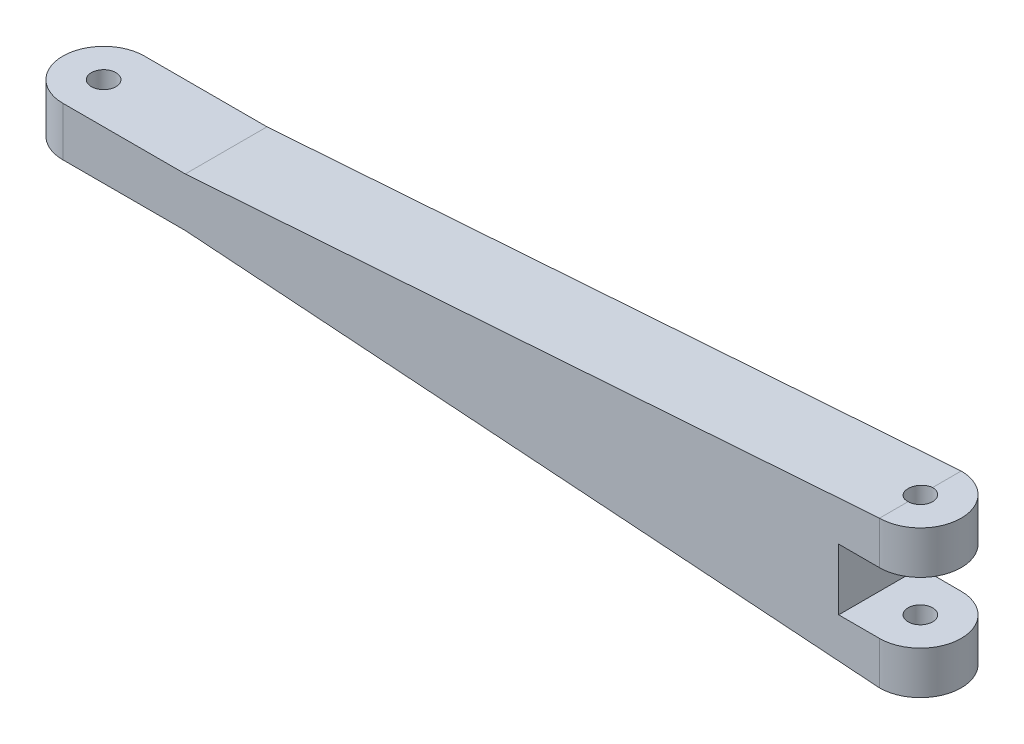
ISO-10303-21;
HEADER;
FILE_DESCRIPTION(('STEP AP214'),'2;1');
FILE_NAME('part.step','',(''),(''),'','','');
FILE_SCHEMA(('AUTOMOTIVE_DESIGN { 1 0 10303 214 1 1 1 1 }'));
ENDSEC;
DATA;
#1=APPLICATION_CONTEXT('core data for automotive mechanical design processes');
#2=APPLICATION_PROTOCOL_DEFINITION('international standard','automotive_design',2000,#1);
#3=PRODUCT_CONTEXT('',#1,'mechanical');
#4=PRODUCT('Part','Part','',(#3));
#5=PRODUCT_RELATED_PRODUCT_CATEGORY('part','',(#4));
#6=PRODUCT_DEFINITION_FORMATION('','',#4);
#7=PRODUCT_DEFINITION_CONTEXT('part definition',#1,'design');
#8=PRODUCT_DEFINITION('design','',#6,#7);
#9=PRODUCT_DEFINITION_SHAPE('','',#8);
#10=(LENGTH_UNIT() NAMED_UNIT(*) SI_UNIT(.MILLI.,.METRE.));
#11=(NAMED_UNIT(*) PLANE_ANGLE_UNIT() SI_UNIT($,.RADIAN.));
#12=(NAMED_UNIT(*) SI_UNIT($,.STERADIAN.) SOLID_ANGLE_UNIT());
#13=UNCERTAINTY_MEASURE_WITH_UNIT(LENGTH_MEASURE(1.E-05),#10,'distance_accuracy_value','');
#14=(GEOMETRIC_REPRESENTATION_CONTEXT(3) GLOBAL_UNCERTAINTY_ASSIGNED_CONTEXT((#13)) GLOBAL_UNIT_ASSIGNED_CONTEXT((#10,
#11,#12)) REPRESENTATION_CONTEXT('',''));
#15=CARTESIAN_POINT('',(0.,0.,0.));
#16=DIRECTION('',(0.,0.,1.));
#17=DIRECTION('',(1.,0.,0.));
#18=AXIS2_PLACEMENT_3D('',#15,#16,#17);
#19=CARTESIAN_POINT('',(0.,4.5,0.));
#20=DIRECTION('',(0.,-1.,0.));
#21=DIRECTION('',(0.,0.,-1.));
#22=AXIS2_PLACEMENT_3D('',#19,#20,#21);
#23=CYLINDRICAL_SURFACE('',#22,2.5);
#24=CARTESIAN_POINT('',(0.,-1.875,0.));
#25=DIRECTION('',(0.,1.,0.));
#26=DIRECTION('',(0.,0.,1.));
#27=AXIS2_PLACEMENT_3D('',#24,#25,#26);
#28=CIRCLE('',#27,2.5);
#29=CARTESIAN_POINT('',(0.,-1.875,2.5));
#30=VERTEX_POINT('',#29);
#31=CARTESIAN_POINT('',(0.,-1.875,-2.5));
#32=VERTEX_POINT('',#31);
#33=EDGE_CURVE('E142',#30,#32,#28,.T.);
#34=ORIENTED_EDGE('',*,*,#33,.F.);
#35=DIRECTION('',(0.,-1.,0.));
#36=VECTOR('',#35,1.);
#37=CARTESIAN_POINT('',(0.,4.5,2.5));
#38=LINE('',#37,#36);
#39=CARTESIAN_POINT('',(0.,-4.5,2.5));
#40=VERTEX_POINT('',#39);
#41=EDGE_CURVE('E224',#30,#40,#38,.T.);
#42=ORIENTED_EDGE('',*,*,#41,.T.);
#43=CARTESIAN_POINT('',(0.,-4.5,0.));
#44=DIRECTION('',(0.,1.,0.));
#45=DIRECTION('',(0.,0.,1.));
#46=AXIS2_PLACEMENT_3D('',#43,#44,#45);
#47=CIRCLE('',#46,2.5);
#48=CARTESIAN_POINT('',(0.,-4.5,-2.5));
#49=VERTEX_POINT('',#48);
#50=EDGE_CURVE('E213',#40,#49,#47,.T.);
#51=ORIENTED_EDGE('',*,*,#50,.T.);
#52=DIRECTION('',(0.,-1.,0.));
#53=VECTOR('',#52,1.);
#54=CARTESIAN_POINT('',(0.,4.5,-2.5));
#55=LINE('',#54,#53);
#56=EDGE_CURVE('E221',#32,#49,#55,.T.);
#57=ORIENTED_EDGE('',*,*,#56,.F.);
#58=EDGE_LOOP('',(#34,#42,#51,#57));
#59=FACE_BOUND('',#58,.T.);
#60=ADVANCED_FACE('F35',(#59),#23,.T.);
#61=CARTESIAN_POINT('',(-50.,4.5,0.));
#62=DIRECTION('',(0.,-1.,0.));
#63=DIRECTION('',(0.,0.,-1.));
#64=AXIS2_PLACEMENT_3D('',#61,#62,#63);
#65=CYLINDRICAL_SURFACE('',#64,2.5);
#66=DIRECTION('',(0.,-1.,0.));
#67=VECTOR('',#66,1.);
#68=CARTESIAN_POINT('',(-50.,4.5,2.5));
#69=LINE('',#68,#67);
#70=CARTESIAN_POINT('',(-50.,1.5,2.5));
#71=VERTEX_POINT('',#70);
#72=CARTESIAN_POINT('',(-50.,-1.5,2.5));
#73=VERTEX_POINT('',#72);
#74=EDGE_CURVE('E11',#71,#73,#69,.T.);
#75=ORIENTED_EDGE('',*,*,#74,.F.);
#76=CARTESIAN_POINT('',(-50.,1.5,0.));
#77=DIRECTION('',(0.,-1.,0.));
#78=DIRECTION('',(0.,0.,-1.));
#79=AXIS2_PLACEMENT_3D('',#76,#77,#78);
#80=CIRCLE('',#79,2.5);
#81=CARTESIAN_POINT('',(-50.,1.5,-2.5));
#82=VERTEX_POINT('',#81);
#83=EDGE_CURVE('E191',#71,#82,#80,.T.);
#84=ORIENTED_EDGE('',*,*,#83,.T.);
#85=DIRECTION('',(0.,-1.,0.));
#86=VECTOR('',#85,1.);
#87=CARTESIAN_POINT('',(-50.,4.5,-2.5));
#88=LINE('',#87,#86);
#89=CARTESIAN_POINT('',(-50.,-1.5,-2.5));
#90=VERTEX_POINT('',#89);
#91=EDGE_CURVE('E217',#82,#90,#88,.T.);
#92=ORIENTED_EDGE('',*,*,#91,.T.);
#93=CARTESIAN_POINT('',(-50.,-1.5,0.));
#94=DIRECTION('',(0.,-1.,0.));
#95=DIRECTION('',(0.,0.,-1.));
#96=AXIS2_PLACEMENT_3D('',#93,#94,#95);
#97=CIRCLE('',#96,2.5);
#98=EDGE_CURVE('E207',#73,#90,#97,.T.);
#99=ORIENTED_EDGE('',*,*,#98,.F.);
#100=EDGE_LOOP('',(#75,#84,#92,#99));
#101=FACE_BOUND('',#100,.T.);
#102=ADVANCED_FACE('F37',(#101),#65,.T.);
#103=CARTESIAN_POINT('',(-50.,4.5,2.5));
#104=DIRECTION('',(0.,0.,-1.));
#105=DIRECTION('',(-1.,0.,0.));
#106=AXIS2_PLACEMENT_3D('',#103,#104,#105);
#107=PLANE('',#106);
#108=ORIENTED_EDGE('',*,*,#41,.F.);
#109=DIRECTION('',(-1.,0.,0.));
#110=VECTOR('',#109,1.);
#111=CARTESIAN_POINT('',(-50.,-1.87500000000001,2.5));
#112=LINE('',#111,#110);
#113=CARTESIAN_POINT('',(-2.5,-1.875,2.5));
#114=VERTEX_POINT('',#113);
#115=EDGE_CURVE('E145',#30,#114,#112,.T.);
#116=ORIENTED_EDGE('',*,*,#115,.T.);
#117=DIRECTION('',(0.,1.,0.));
#118=VECTOR('',#117,1.);
#119=CARTESIAN_POINT('',(-2.5,4.5,2.5));
#120=LINE('',#119,#118);
#121=CARTESIAN_POINT('',(-2.5,1.875,2.5));
#122=VERTEX_POINT('',#121);
#123=EDGE_CURVE('E133',#114,#122,#120,.T.);
#124=ORIENTED_EDGE('',*,*,#123,.T.);
#125=DIRECTION('',(1.,0.,0.));
#126=VECTOR('',#125,1.);
#127=CARTESIAN_POINT('',(-50.,1.87499999999999,2.5));
#128=LINE('',#127,#126);
#129=CARTESIAN_POINT('',(0.,1.875,2.5));
#130=VERTEX_POINT('',#129);
#131=EDGE_CURVE('E153',#122,#130,#128,.T.);
#132=ORIENTED_EDGE('',*,*,#131,.T.);
#133=CARTESIAN_POINT('',(0.,4.5,2.5));
#134=VERTEX_POINT('',#133);
#135=EDGE_CURVE('E44',#134,#130,#38,.T.);
#136=ORIENTED_EDGE('',*,*,#135,.F.);
#137=DIRECTION('',(0.99751792226177,0.0704130298067132,0.));
#138=VECTOR('',#137,1.);
#139=CARTESIAN_POINT('',(-42.5,1.5,2.5));
#140=LINE('',#139,#138);
#141=CARTESIAN_POINT('',(-42.5,1.5,2.5));
#142=VERTEX_POINT('',#141);
#143=EDGE_CURVE('E188',#142,#134,#140,.T.);
#144=ORIENTED_EDGE('',*,*,#143,.F.);
#145=DIRECTION('',(1.,0.,0.));
#146=VECTOR('',#145,1.);
#147=CARTESIAN_POINT('',(-52.5,1.5,2.5));
#148=LINE('',#147,#146);
#149=EDGE_CURVE('E186',#71,#142,#148,.T.);
#150=ORIENTED_EDGE('',*,*,#149,.F.);
#151=ORIENTED_EDGE('',*,*,#74,.T.);
#152=DIRECTION('',(1.,0.,0.));
#153=VECTOR('',#152,1.);
#154=CARTESIAN_POINT('',(-52.5,-1.5,2.5));
#155=LINE('',#154,#153);
#156=CARTESIAN_POINT('',(-42.5,-1.5,2.5));
#157=VERTEX_POINT('',#156);
#158=EDGE_CURVE('E196',#73,#157,#155,.T.);
#159=ORIENTED_EDGE('',*,*,#158,.T.);
#160=DIRECTION('',(0.99751792226177,-0.0704130298067132,0.));
#161=VECTOR('',#160,1.);
#162=CARTESIAN_POINT('',(-42.5,-1.5,2.5));
#163=LINE('',#162,#161);
#164=EDGE_CURVE('E193',#157,#40,#163,.T.);
#165=ORIENTED_EDGE('',*,*,#164,.T.);
#166=EDGE_LOOP('',(#108,#116,#124,#132,#136,#144,#150,#151,#159,#165));
#167=FACE_BOUND('',#166,.T.);
#168=ADVANCED_FACE('F251',(#167),#107,.F.);
#169=CARTESIAN_POINT('',(-50.,4.5,-2.5));
#170=DIRECTION('',(0.,0.,-1.));
#171=DIRECTION('',(-1.,0.,0.));
#172=AXIS2_PLACEMENT_3D('',#169,#170,#171);
#173=PLANE('',#172);
#174=DIRECTION('',(-1.,0.,0.));
#175=VECTOR('',#174,1.);
#176=CARTESIAN_POINT('',(-50.,-1.87500000000001,-2.5));
#177=LINE('',#176,#175);
#178=CARTESIAN_POINT('',(-2.5,-1.875,-2.5));
#179=VERTEX_POINT('',#178);
#180=EDGE_CURVE('E136',#32,#179,#177,.T.);
#181=ORIENTED_EDGE('',*,*,#180,.F.);
#182=ORIENTED_EDGE('',*,*,#56,.T.);
#183=DIRECTION('',(0.99751792226177,-0.0704130298067132,0.));
#184=VECTOR('',#183,1.);
#185=CARTESIAN_POINT('',(-42.5,-1.5,-2.5));
#186=LINE('',#185,#184);
#187=CARTESIAN_POINT('',(-42.5,-1.5,-2.5));
#188=VERTEX_POINT('',#187);
#189=EDGE_CURVE('E199',#188,#49,#186,.T.);
#190=ORIENTED_EDGE('',*,*,#189,.F.);
#191=DIRECTION('',(1.,0.,0.));
#192=VECTOR('',#191,1.);
#193=CARTESIAN_POINT('',(-52.5,-1.5,-2.5));
#194=LINE('',#193,#192);
#195=EDGE_CURVE('E202',#90,#188,#194,.T.);
#196=ORIENTED_EDGE('',*,*,#195,.F.);
#197=ORIENTED_EDGE('',*,*,#91,.F.);
#198=DIRECTION('',(1.,0.,0.));
#199=VECTOR('',#198,1.);
#200=CARTESIAN_POINT('',(-52.5,1.5,-2.5));
#201=LINE('',#200,#199);
#202=CARTESIAN_POINT('',(-42.5,1.5,-2.5));
#203=VERTEX_POINT('',#202);
#204=EDGE_CURVE('E177',#82,#203,#201,.T.);
#205=ORIENTED_EDGE('',*,*,#204,.T.);
#206=DIRECTION('',(0.99751792226177,0.0704130298067132,0.));
#207=VECTOR('',#206,1.);
#208=CARTESIAN_POINT('',(-42.5,1.5,-2.5));
#209=LINE('',#208,#207);
#210=CARTESIAN_POINT('',(0.,4.5,-2.5));
#211=VERTEX_POINT('',#210);
#212=EDGE_CURVE('E183',#203,#211,#209,.T.);
#213=ORIENTED_EDGE('',*,*,#212,.T.);
#214=CARTESIAN_POINT('',(0.,1.875,-2.5));
#215=VERTEX_POINT('',#214);
#216=EDGE_CURVE('E222',#211,#215,#55,.T.);
#217=ORIENTED_EDGE('',*,*,#216,.T.);
#218=DIRECTION('',(1.,0.,0.));
#219=VECTOR('',#218,1.);
#220=CARTESIAN_POINT('',(-50.,1.87499999999999,-2.5));
#221=LINE('',#220,#219);
#222=CARTESIAN_POINT('',(-2.5,1.875,-2.5));
#223=VERTEX_POINT('',#222);
#224=EDGE_CURVE('E150',#223,#215,#221,.T.);
#225=ORIENTED_EDGE('',*,*,#224,.F.);
#226=DIRECTION('',(0.,1.,0.));
#227=VECTOR('',#226,1.);
#228=CARTESIAN_POINT('',(-2.5,4.5,-2.5));
#229=LINE('',#228,#227);
#230=EDGE_CURVE('E130',#179,#223,#229,.T.);
#231=ORIENTED_EDGE('',*,*,#230,.F.);
#232=EDGE_LOOP('',(#181,#182,#190,#196,#197,#205,#213,#217,#225,#231));
#233=FACE_BOUND('',#232,.T.);
#234=ADVANCED_FACE('F147',(#233),#173,.T.);
#235=CARTESIAN_POINT('',(-50.,-4.5,0.));
#236=DIRECTION('',(0.,1.,0.));
#237=DIRECTION('',(0.,0.,1.));
#238=AXIS2_PLACEMENT_3D('',#235,#236,#237);
#239=PLANE('',#238);
#240=DIRECTION('',(0.,0.,1.));
#241=VECTOR('',#240,1.);
#242=CARTESIAN_POINT('',(0.,-4.5,-2.5));
#243=LINE('',#242,#241);
#244=CARTESIAN_POINT('',(0.,-4.5,0.75));
#245=VERTEX_POINT('',#244);
#246=EDGE_CURVE('E204',#245,#40,#243,.T.);
#247=ORIENTED_EDGE('',*,*,#246,.F.);
#248=CARTESIAN_POINT('',(0.,-4.5,0.));
#249=DIRECTION('',(0.,1.,0.));
#250=DIRECTION('',(0.,0.,1.));
#251=AXIS2_PLACEMENT_3D('',#248,#249,#250);
#252=CIRCLE('',#251,0.75);
#253=CARTESIAN_POINT('',(0.,-4.5,-0.75));
#254=VERTEX_POINT('',#253);
#255=EDGE_CURVE('E51',#245,#254,#252,.T.);
#256=ORIENTED_EDGE('',*,*,#255,.T.);
#257=EDGE_CURVE('E208',#49,#254,#243,.T.);
#258=ORIENTED_EDGE('',*,*,#257,.F.);
#259=ORIENTED_EDGE('',*,*,#50,.F.);
#260=EDGE_LOOP('',(#247,#256,#258,#259));
#261=FACE_BOUND('',#260,.T.);
#262=ADVANCED_FACE('F256',(#261),#239,.F.);
#263=ORIENTED_EDGE('',*,*,#135,.T.);
#264=CARTESIAN_POINT('',(0.,1.875,0.));
#265=DIRECTION('',(0.,1.,0.));
#266=DIRECTION('',(0.,0.,1.));
#267=AXIS2_PLACEMENT_3D('',#264,#265,#266);
#268=CIRCLE('',#267,2.5);
#269=EDGE_CURVE('E170',#130,#215,#268,.T.);
#270=ORIENTED_EDGE('',*,*,#269,.T.);
#271=ORIENTED_EDGE('',*,*,#216,.F.);
#272=CARTESIAN_POINT('',(0.,4.5,0.));
#273=DIRECTION('',(0.,1.,0.));
#274=DIRECTION('',(0.,0.,1.));
#275=AXIS2_PLACEMENT_3D('',#272,#273,#274);
#276=CIRCLE('',#275,2.5);
#277=EDGE_CURVE('E214',#134,#211,#276,.T.);
#278=ORIENTED_EDGE('',*,*,#277,.F.);
#279=EDGE_LOOP('',(#263,#270,#271,#278));
#280=FACE_BOUND('',#279,.T.);
#281=ADVANCED_FACE('F247',(#280),#23,.T.);
#282=CARTESIAN_POINT('',(-50.,4.5,0.));
#283=DIRECTION('',(0.,1.,0.));
#284=DIRECTION('',(0.,0.,1.));
#285=AXIS2_PLACEMENT_3D('',#282,#283,#284);
#286=PLANE('',#285);
#287=CARTESIAN_POINT('',(0.,4.5,0.));
#288=DIRECTION('',(0.,1.,0.));
#289=DIRECTION('',(0.,0.,1.));
#290=AXIS2_PLACEMENT_3D('',#287,#288,#289);
#291=CIRCLE('',#290,0.75);
#292=CARTESIAN_POINT('',(0.,4.5,0.75));
#293=VERTEX_POINT('',#292);
#294=CARTESIAN_POINT('',(0.,4.5,-0.75));
#295=VERTEX_POINT('',#294);
#296=EDGE_CURVE('E58',#293,#295,#291,.T.);
#297=ORIENTED_EDGE('',*,*,#296,.F.);
#298=DIRECTION('',(0.,0.,1.));
#299=VECTOR('',#298,1.);
#300=CARTESIAN_POINT('',(0.,4.5,-2.5));
#301=LINE('',#300,#299);
#302=EDGE_CURVE('E178',#293,#134,#301,.T.);
#303=ORIENTED_EDGE('',*,*,#302,.T.);
#304=ORIENTED_EDGE('',*,*,#277,.T.);
#305=EDGE_CURVE('E174',#211,#295,#301,.T.);
#306=ORIENTED_EDGE('',*,*,#305,.T.);
#307=EDGE_LOOP('',(#297,#303,#304,#306));
#308=FACE_BOUND('',#307,.T.);
#309=ADVANCED_FACE('F255',(#308),#286,.T.);
#310=CARTESIAN_POINT('',(-52.5,-1.5,-2.5));
#311=DIRECTION('',(0.,-1.,0.));
#312=DIRECTION('',(0.,0.,-1.));
#313=AXIS2_PLACEMENT_3D('',#310,#311,#312);
#314=PLANE('',#313);
#315=CARTESIAN_POINT('',(-50.,-1.5,0.));
#316=DIRECTION('',(0.,-1.,0.));
#317=DIRECTION('',(0.,0.,-1.));
#318=AXIS2_PLACEMENT_3D('',#315,#316,#317);
#319=CIRCLE('',#318,0.749999999999999);
#320=CARTESIAN_POINT('',(-50.,-1.5,-0.749999999999999));
#321=VERTEX_POINT('',#320);
#322=EDGE_CURVE('E157',#321,#321,#319,.T.);
#323=ORIENTED_EDGE('',*,*,#322,.F.);
#324=EDGE_LOOP('',(#323));
#325=FACE_BOUND('',#324,.T.);
#326=ORIENTED_EDGE('',*,*,#98,.T.);
#327=ORIENTED_EDGE('',*,*,#195,.T.);
#328=DIRECTION('',(0.,0.,1.));
#329=VECTOR('',#328,1.);
#330=CARTESIAN_POINT('',(-42.5,-1.5,-2.5));
#331=LINE('',#330,#329);
#332=EDGE_CURVE('E205',#188,#157,#331,.T.);
#333=ORIENTED_EDGE('',*,*,#332,.T.);
#334=ORIENTED_EDGE('',*,*,#158,.F.);
#335=EDGE_LOOP('',(#326,#327,#333,#334));
#336=FACE_BOUND('',#335,.T.);
#337=ADVANCED_FACE('F262',(#325,#336),#314,.T.);
#338=CARTESIAN_POINT('',(-42.5,-1.5,-2.5));
#339=DIRECTION('',(-0.0704130298067132,-0.99751792226177,0.));
#340=DIRECTION('',(0.99751792226177,-0.0704130298067132,0.));
#341=AXIS2_PLACEMENT_3D('',#338,#339,#340);
#342=PLANE('',#341);
#343=CARTESIAN_POINT('',(0.,-4.5,0.));
#344=DIRECTION('',(-0.0704130298067132,-0.99751792226177,0.));
#345=DIRECTION('',(-0.99751792226177,0.0704130298067132,0.));
#346=AXIS2_PLACEMENT_3D('',#343,#344,#345);
#347=ELLIPSE('',#346,0.751866190333154,0.75);
#348=EDGE_CURVE('E168',#245,#254,#347,.T.);
#349=ORIENTED_EDGE('',*,*,#348,.F.);
#350=ORIENTED_EDGE('',*,*,#246,.T.);
#351=ORIENTED_EDGE('',*,*,#164,.F.);
#352=ORIENTED_EDGE('',*,*,#332,.F.);
#353=ORIENTED_EDGE('',*,*,#189,.T.);
#354=ORIENTED_EDGE('',*,*,#257,.T.);
#355=EDGE_LOOP('',(#349,#350,#351,#352,#353,#354));
#356=FACE_BOUND('',#355,.T.);
#357=ADVANCED_FACE('F292',(#356),#342,.T.);
#358=CARTESIAN_POINT('',(-52.5,1.5,-2.5));
#359=DIRECTION('',(0.,-1.,0.));
#360=DIRECTION('',(0.,0.,-1.));
#361=AXIS2_PLACEMENT_3D('',#358,#359,#360);
#362=PLANE('',#361);
#363=CARTESIAN_POINT('',(-50.,1.5,0.));
#364=DIRECTION('',(0.,-1.,0.));
#365=DIRECTION('',(0.,0.,-1.));
#366=AXIS2_PLACEMENT_3D('',#363,#364,#365);
#367=CIRCLE('',#366,0.749999999999999);
#368=CARTESIAN_POINT('',(-50.,1.5,-0.749999999999999));
#369=VERTEX_POINT('',#368);
#370=EDGE_CURVE('E39',#369,#369,#367,.T.);
#371=ORIENTED_EDGE('',*,*,#370,.T.);
#372=EDGE_LOOP('',(#371));
#373=FACE_BOUND('',#372,.T.);
#374=ORIENTED_EDGE('',*,*,#149,.T.);
#375=DIRECTION('',(0.,0.,1.));
#376=VECTOR('',#375,1.);
#377=CARTESIAN_POINT('',(-42.5,1.5,-2.5));
#378=LINE('',#377,#376);
#379=EDGE_CURVE('E172',#203,#142,#378,.T.);
#380=ORIENTED_EDGE('',*,*,#379,.F.);
#381=ORIENTED_EDGE('',*,*,#204,.F.);
#382=ORIENTED_EDGE('',*,*,#83,.F.);
#383=EDGE_LOOP('',(#374,#380,#381,#382));
#384=FACE_BOUND('',#383,.T.);
#385=ADVANCED_FACE('F282',(#373,#384),#362,.F.);
#386=CARTESIAN_POINT('',(-42.5,1.5,-2.5));
#387=DIRECTION('',(0.0704130298067132,-0.99751792226177,0.));
#388=DIRECTION('',(0.99751792226177,0.0704130298067132,0.));
#389=AXIS2_PLACEMENT_3D('',#386,#387,#388);
#390=PLANE('',#389);
#391=ORIENTED_EDGE('',*,*,#302,.F.);
#392=CARTESIAN_POINT('',(0.,4.5,0.));
#393=DIRECTION('',(0.0704130298067132,-0.99751792226177,0.));
#394=DIRECTION('',(0.99751792226177,0.0704130298067132,0.));
#395=AXIS2_PLACEMENT_3D('',#392,#393,#394);
#396=ELLIPSE('',#395,0.751866190333154,0.75);
#397=EDGE_CURVE('E166',#293,#295,#396,.T.);
#398=ORIENTED_EDGE('',*,*,#397,.T.);
#399=ORIENTED_EDGE('',*,*,#305,.F.);
#400=ORIENTED_EDGE('',*,*,#212,.F.);
#401=ORIENTED_EDGE('',*,*,#379,.T.);
#402=ORIENTED_EDGE('',*,*,#143,.T.);
#403=EDGE_LOOP('',(#391,#398,#399,#400,#401,#402));
#404=FACE_BOUND('',#403,.T.);
#405=ADVANCED_FACE('F280',(#404),#390,.F.);
#406=CARTESIAN_POINT('',(0.,-1.875,0.));
#407=DIRECTION('',(0.,1.,0.));
#408=DIRECTION('',(0.,0.,1.));
#409=AXIS2_PLACEMENT_3D('',#406,#407,#408);
#410=PLANE('',#409);
#411=CARTESIAN_POINT('',(0.,-1.875,0.));
#412=DIRECTION('',(0.,1.,0.));
#413=DIRECTION('',(0.,0.,1.));
#414=AXIS2_PLACEMENT_3D('',#411,#412,#413);
#415=CIRCLE('',#414,0.75);
#416=CARTESIAN_POINT('',(0.,-1.875,0.75));
#417=VERTEX_POINT('',#416);
#418=EDGE_CURVE('E163',#417,#417,#415,.T.);
#419=ORIENTED_EDGE('',*,*,#418,.F.);
#420=EDGE_LOOP('',(#419));
#421=FACE_BOUND('',#420,.T.);
#422=ORIENTED_EDGE('',*,*,#33,.T.);
#423=ORIENTED_EDGE('',*,*,#180,.T.);
#424=DIRECTION('',(0.,0.,1.));
#425=VECTOR('',#424,1.);
#426=CARTESIAN_POINT('',(-2.5,-1.875,-20.));
#427=LINE('',#426,#425);
#428=EDGE_CURVE('E125',#179,#114,#427,.T.);
#429=ORIENTED_EDGE('',*,*,#428,.T.);
#430=ORIENTED_EDGE('',*,*,#115,.F.);
#431=EDGE_LOOP('',(#422,#423,#429,#430));
#432=FACE_BOUND('',#431,.T.);
#433=ADVANCED_FACE('F140',(#421,#432),#410,.T.);
#434=CARTESIAN_POINT('',(0.,1.875,0.));
#435=DIRECTION('',(0.,1.,0.));
#436=DIRECTION('',(0.,0.,1.));
#437=AXIS2_PLACEMENT_3D('',#434,#435,#436);
#438=PLANE('',#437);
#439=CARTESIAN_POINT('',(0.,1.875,0.));
#440=DIRECTION('',(0.,1.,0.));
#441=DIRECTION('',(0.,0.,1.));
#442=AXIS2_PLACEMENT_3D('',#439,#440,#441);
#443=CIRCLE('',#442,0.75);
#444=CARTESIAN_POINT('',(0.,1.875,0.75));
#445=VERTEX_POINT('',#444);
#446=EDGE_CURVE('E162',#445,#445,#443,.T.);
#447=ORIENTED_EDGE('',*,*,#446,.T.);
#448=EDGE_LOOP('',(#447));
#449=FACE_BOUND('',#448,.T.);
#450=ORIENTED_EDGE('',*,*,#269,.F.);
#451=ORIENTED_EDGE('',*,*,#131,.F.);
#452=DIRECTION('',(0.,0.,1.));
#453=VECTOR('',#452,1.);
#454=CARTESIAN_POINT('',(-2.5,1.875,-20.));
#455=LINE('',#454,#453);
#456=EDGE_CURVE('E137',#223,#122,#455,.T.);
#457=ORIENTED_EDGE('',*,*,#456,.F.);
#458=ORIENTED_EDGE('',*,*,#224,.T.);
#459=EDGE_LOOP('',(#450,#451,#457,#458));
#460=FACE_BOUND('',#459,.T.);
#461=ADVANCED_FACE('F229',(#449,#460),#438,.F.);
#462=CARTESIAN_POINT('',(0.,-4.5,0.));
#463=DIRECTION('',(0.,1.,0.));
#464=DIRECTION('',(0.,0.,1.));
#465=AXIS2_PLACEMENT_3D('',#462,#463,#464);
#466=CYLINDRICAL_SURFACE('',#465,0.75);
#467=ORIENTED_EDGE('',*,*,#446,.F.);
#468=EDGE_LOOP('',(#467));
#469=FACE_BOUND('',#468,.T.);
#470=ORIENTED_EDGE('',*,*,#296,.T.);
#471=ORIENTED_EDGE('',*,*,#397,.F.);
#472=EDGE_LOOP('',(#470,#471));
#473=FACE_BOUND('',#472,.T.);
#474=ADVANCED_FACE('F232',(#469,#473),#466,.F.);
#475=ORIENTED_EDGE('',*,*,#348,.T.);
#476=ORIENTED_EDGE('',*,*,#255,.F.);
#477=EDGE_LOOP('',(#475,#476));
#478=FACE_BOUND('',#477,.T.);
#479=ORIENTED_EDGE('',*,*,#418,.T.);
#480=EDGE_LOOP('',(#479));
#481=FACE_BOUND('',#480,.T.);
#482=ADVANCED_FACE('F234',(#478,#481),#466,.F.);
#483=CARTESIAN_POINT('',(-50.,-4.5,0.));
#484=DIRECTION('',(0.,1.,0.));
#485=DIRECTION('',(0.,0.,1.));
#486=AXIS2_PLACEMENT_3D('',#483,#484,#485);
#487=CYLINDRICAL_SURFACE('',#486,0.749999999999999);
#488=ORIENTED_EDGE('',*,*,#322,.T.);
#489=EDGE_LOOP('',(#488));
#490=FACE_BOUND('',#489,.T.);
#491=ORIENTED_EDGE('',*,*,#370,.F.);
#492=EDGE_LOOP('',(#491));
#493=FACE_BOUND('',#492,.T.);
#494=ADVANCED_FACE('F240',(#490,#493),#487,.F.);
#495=CARTESIAN_POINT('',(-2.5,-1.875,-20.));
#496=DIRECTION('',(-1.,0.,0.));
#497=DIRECTION('',(0.,0.,1.));
#498=AXIS2_PLACEMENT_3D('',#495,#496,#497);
#499=PLANE('',#498);
#500=ORIENTED_EDGE('',*,*,#428,.F.);
#501=ORIENTED_EDGE('',*,*,#230,.T.);
#502=ORIENTED_EDGE('',*,*,#456,.T.);
#503=ORIENTED_EDGE('',*,*,#123,.F.);
#504=EDGE_LOOP('',(#500,#501,#502,#503));
#505=FACE_BOUND('',#504,.T.);
#506=ADVANCED_FACE('F127',(#505),#499,.F.);
#507=CLOSED_SHELL('',(#60,#102,#168,#234,#262,#281,#309,#337,#357,#385,#405,#433,#461,#474,#482,
#494,#506));
#508=MANIFOLD_SOLID_BREP('B2',#507);
#509=ADVANCED_BREP_SHAPE_REPRESENTATION('',(#18,#508),#14);
#510=SHAPE_DEFINITION_REPRESENTATION(#9,#509);
ENDSEC;
END-ISO-10303-21;
